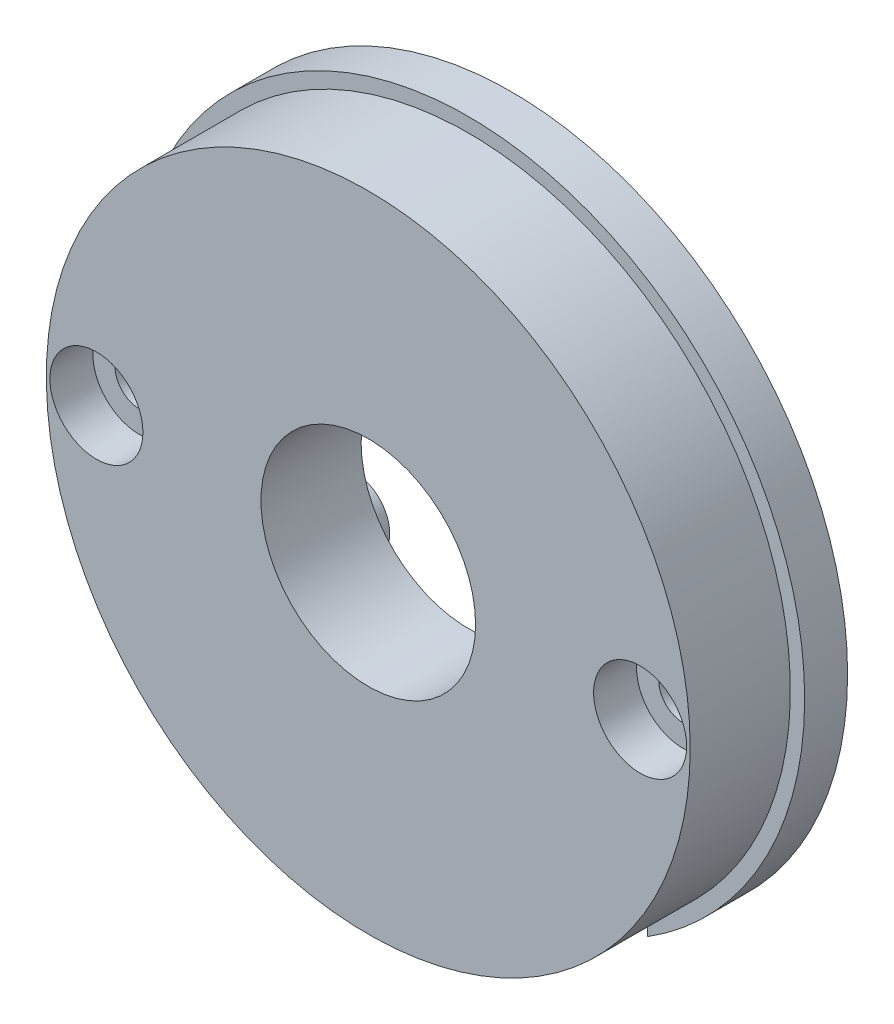
ISO-10303-21;
HEADER;
FILE_DESCRIPTION(('STEP AP214'),'2;1');
FILE_NAME('part.step','',(''),(''),'','','');
FILE_SCHEMA(('AUTOMOTIVE_DESIGN { 1 0 10303 214 1 1 1 1 }'));
ENDSEC;
DATA;
#1=APPLICATION_CONTEXT('core data for automotive mechanical design processes');
#2=APPLICATION_PROTOCOL_DEFINITION('international standard','automotive_design',2000,#1);
#3=PRODUCT_CONTEXT('',#1,'mechanical');
#4=PRODUCT('Part','Part','',(#3));
#5=PRODUCT_RELATED_PRODUCT_CATEGORY('part','',(#4));
#6=PRODUCT_DEFINITION_FORMATION('','',#4);
#7=PRODUCT_DEFINITION_CONTEXT('part definition',#1,'design');
#8=PRODUCT_DEFINITION('design','',#6,#7);
#9=PRODUCT_DEFINITION_SHAPE('','',#8);
#10=(LENGTH_UNIT() NAMED_UNIT(*) SI_UNIT(.MILLI.,.METRE.));
#11=(NAMED_UNIT(*) PLANE_ANGLE_UNIT() SI_UNIT($,.RADIAN.));
#12=(NAMED_UNIT(*) SI_UNIT($,.STERADIAN.) SOLID_ANGLE_UNIT());
#13=UNCERTAINTY_MEASURE_WITH_UNIT(LENGTH_MEASURE(1.E-05),#10,'distance_accuracy_value','');
#14=(GEOMETRIC_REPRESENTATION_CONTEXT(3) GLOBAL_UNCERTAINTY_ASSIGNED_CONTEXT((#13)) GLOBAL_UNIT_ASSIGNED_CONTEXT((#10,
#11,#12)) REPRESENTATION_CONTEXT('',''));
#15=CARTESIAN_POINT('',(0.,0.,0.));
#16=DIRECTION('',(0.,0.,1.));
#17=DIRECTION('',(1.,0.,0.));
#18=AXIS2_PLACEMENT_3D('',#15,#16,#17);
#19=CARTESIAN_POINT('',(0.,0.,10.));
#20=DIRECTION('',(0.,0.,-1.));
#21=DIRECTION('',(-1.,0.,0.));
#22=AXIS2_PLACEMENT_3D('',#19,#20,#21);
#23=CYLINDRICAL_SURFACE('',#22,22.5);
#24=CARTESIAN_POINT('',(0.,0.,10.));
#25=DIRECTION('',(0.,0.,1.));
#26=DIRECTION('',(1.,0.,0.));
#27=AXIS2_PLACEMENT_3D('',#24,#25,#26);
#28=CIRCLE('',#27,22.5);
#29=CARTESIAN_POINT('',(22.5,0.,10.));
#30=VERTEX_POINT('',#29);
#31=EDGE_CURVE('E396',#30,#30,#28,.T.);
#32=ORIENTED_EDGE('',*,*,#31,.F.);
#33=EDGE_LOOP('',(#32));
#34=FACE_BOUND('',#33,.T.);
#35=CARTESIAN_POINT('',(0.,0.,3.));
#36=DIRECTION('',(0.,0.,-1.));
#37=DIRECTION('',(-1.,0.,0.));
#38=AXIS2_PLACEMENT_3D('',#35,#36,#37);
#39=CIRCLE('',#38,22.5);
#40=CARTESIAN_POINT('',(-12.5,-18.7082869338697,3.));
#41=VERTEX_POINT('',#40);
#42=CARTESIAN_POINT('',(12.5,-18.7082869338697,3.));
#43=VERTEX_POINT('',#42);
#44=EDGE_CURVE('E191',#41,#43,#39,.T.);
#45=ORIENTED_EDGE('',*,*,#44,.F.);
#46=CARTESIAN_POINT('',(0.,0.,3.));
#47=DIRECTION('',(0.,0.,-1.));
#48=DIRECTION('',(-1.,0.,0.));
#49=AXIS2_PLACEMENT_3D('',#46,#47,#48);
#50=CIRCLE('',#49,22.5);
#51=EDGE_CURVE('E11',#43,#41,#50,.T.);
#52=ORIENTED_EDGE('',*,*,#51,.F.);
#53=EDGE_LOOP('',(#45,#52));
#54=FACE_BOUND('',#53,.T.);
#55=ADVANCED_FACE('F35',(#34,#54),#23,.T.);
#56=CARTESIAN_POINT('',(0.,0.,3.));
#57=DIRECTION('',(0.,0.,-1.));
#58=DIRECTION('',(-1.,0.,0.));
#59=AXIS2_PLACEMENT_3D('',#56,#57,#58);
#60=PLANE('',#59);
#61=CARTESIAN_POINT('',(0.,0.,3.));
#62=DIRECTION('',(0.,0.,-1.));
#63=DIRECTION('',(-1.,0.,0.));
#64=AXIS2_PLACEMENT_3D('',#61,#62,#63);
#65=CIRCLE('',#64,7.5);
#66=CARTESIAN_POINT('',(-7.5,0.,3.));
#67=VERTEX_POINT('',#66);
#68=EDGE_CURVE('E216',#67,#67,#65,.T.);
#69=ORIENTED_EDGE('',*,*,#68,.F.);
#70=EDGE_LOOP('',(#69));
#71=FACE_BOUND('',#70,.T.);
#72=DIRECTION('',(1.,0.,0.));
#73=VECTOR('',#72,1.);
#74=CARTESIAN_POINT('',(12.5,-8.,3.));
#75=LINE('',#74,#73);
#76=CARTESIAN_POINT('',(9.,-8.,3.));
#77=VERTEX_POINT('',#76);
#78=CARTESIAN_POINT('',(12.5,-8.,3.));
#79=VERTEX_POINT('',#78);
#80=EDGE_CURVE('E223',#77,#79,#75,.T.);
#81=ORIENTED_EDGE('',*,*,#80,.T.);
#82=DIRECTION('',(0.,-1.,0.));
#83=VECTOR('',#82,1.);
#84=CARTESIAN_POINT('',(12.5,17.5,3.));
#85=LINE('',#84,#83);
#86=EDGE_CURVE('E359',#79,#43,#85,.T.);
#87=ORIENTED_EDGE('',*,*,#86,.T.);
#88=ORIENTED_EDGE('',*,*,#51,.T.);
#89=DIRECTION('',(0.,1.,0.));
#90=VECTOR('',#89,1.);
#91=CARTESIAN_POINT('',(-12.5,17.5,3.));
#92=LINE('',#91,#90);
#93=CARTESIAN_POINT('',(-12.5,-8.,3.));
#94=VERTEX_POINT('',#93);
#95=EDGE_CURVE('E206',#41,#94,#92,.T.);
#96=ORIENTED_EDGE('',*,*,#95,.T.);
#97=DIRECTION('',(-1.,0.,0.));
#98=VECTOR('',#97,1.);
#99=CARTESIAN_POINT('',(-12.5,-8.,3.));
#100=LINE('',#99,#98);
#101=CARTESIAN_POINT('',(-9.,-8.,3.));
#102=VERTEX_POINT('',#101);
#103=EDGE_CURVE('E264',#102,#94,#100,.T.);
#104=ORIENTED_EDGE('',*,*,#103,.F.);
#105=CARTESIAN_POINT('',(-9.,-5.5,3.));
#106=DIRECTION('',(0.,0.,-1.));
#107=DIRECTION('',(1.,0.,0.));
#108=AXIS2_PLACEMENT_3D('',#105,#106,#107);
#109=CIRCLE('',#108,2.5);
#110=CARTESIAN_POINT('',(-9.,-3.,3.));
#111=VERTEX_POINT('',#110);
#112=EDGE_CURVE('E271',#111,#102,#109,.T.);
#113=ORIENTED_EDGE('',*,*,#112,.F.);
#114=DIRECTION('',(1.,0.,0.));
#115=VECTOR('',#114,1.);
#116=CARTESIAN_POINT('',(-12.5,-3.,3.));
#117=LINE('',#116,#115);
#118=CARTESIAN_POINT('',(-12.5,-3.,3.));
#119=VERTEX_POINT('',#118);
#120=EDGE_CURVE('E257',#119,#111,#117,.T.);
#121=ORIENTED_EDGE('',*,*,#120,.F.);
#122=CARTESIAN_POINT('',(-12.5,3.,3.));
#123=VERTEX_POINT('',#122);
#124=EDGE_CURVE('E355',#119,#123,#92,.T.);
#125=ORIENTED_EDGE('',*,*,#124,.T.);
#126=DIRECTION('',(1.,0.,0.));
#127=VECTOR('',#126,1.);
#128=CARTESIAN_POINT('',(-12.5,3.,3.));
#129=LINE('',#128,#127);
#130=CARTESIAN_POINT('',(-9.,3.,3.));
#131=VERTEX_POINT('',#130);
#132=EDGE_CURVE('E294',#123,#131,#129,.T.);
#133=ORIENTED_EDGE('',*,*,#132,.T.);
#134=CARTESIAN_POINT('',(-9.,5.5,3.));
#135=DIRECTION('',(0.,0.,1.));
#136=DIRECTION('',(1.,0.,0.));
#137=AXIS2_PLACEMENT_3D('',#134,#135,#136);
#138=CIRCLE('',#137,2.5);
#139=CARTESIAN_POINT('',(-9.,8.,3.));
#140=VERTEX_POINT('',#139);
#141=EDGE_CURVE('E306',#131,#140,#138,.T.);
#142=ORIENTED_EDGE('',*,*,#141,.T.);
#143=DIRECTION('',(-1.,0.,0.));
#144=VECTOR('',#143,1.);
#145=CARTESIAN_POINT('',(-12.5,8.,3.));
#146=LINE('',#145,#144);
#147=CARTESIAN_POINT('',(-12.5,8.,3.));
#148=VERTEX_POINT('',#147);
#149=EDGE_CURVE('E287',#140,#148,#146,.T.);
#150=ORIENTED_EDGE('',*,*,#149,.T.);
#151=CARTESIAN_POINT('',(-12.5,17.5,3.));
#152=VERTEX_POINT('',#151);
#153=EDGE_CURVE('E356',#148,#152,#92,.T.);
#154=ORIENTED_EDGE('',*,*,#153,.T.);
#155=DIRECTION('',(1.,0.,0.));
#156=VECTOR('',#155,1.);
#157=CARTESIAN_POINT('',(12.5,17.5,3.));
#158=LINE('',#157,#156);
#159=CARTESIAN_POINT('',(12.5,17.5,3.));
#160=VERTEX_POINT('',#159);
#161=EDGE_CURVE('E354',#152,#160,#158,.T.);
#162=ORIENTED_EDGE('',*,*,#161,.T.);
#163=CARTESIAN_POINT('',(12.5,8.,3.));
#164=VERTEX_POINT('',#163);
#165=EDGE_CURVE('E360',#160,#164,#85,.T.);
#166=ORIENTED_EDGE('',*,*,#165,.T.);
#167=DIRECTION('',(1.,0.,0.));
#168=VECTOR('',#167,1.);
#169=CARTESIAN_POINT('',(12.5,8.,3.));
#170=LINE('',#169,#168);
#171=CARTESIAN_POINT('',(9.,8.,3.));
#172=VERTEX_POINT('',#171);
#173=EDGE_CURVE('E330',#172,#164,#170,.T.);
#174=ORIENTED_EDGE('',*,*,#173,.F.);
#175=CARTESIAN_POINT('',(9.,5.5,3.));
#176=DIRECTION('',(0.,0.,-1.));
#177=DIRECTION('',(-1.,0.,0.));
#178=AXIS2_PLACEMENT_3D('',#175,#176,#177);
#179=CIRCLE('',#178,2.5);
#180=CARTESIAN_POINT('',(9.,3.,3.));
#181=VERTEX_POINT('',#180);
#182=EDGE_CURVE('E339',#181,#172,#179,.T.);
#183=ORIENTED_EDGE('',*,*,#182,.F.);
#184=DIRECTION('',(-1.,0.,0.));
#185=VECTOR('',#184,1.);
#186=CARTESIAN_POINT('',(12.5,3.,3.));
#187=LINE('',#186,#185);
#188=CARTESIAN_POINT('',(12.5,3.,3.));
#189=VERTEX_POINT('',#188);
#190=EDGE_CURVE('E323',#189,#181,#187,.T.);
#191=ORIENTED_EDGE('',*,*,#190,.F.);
#192=CARTESIAN_POINT('',(12.5,-3.,3.));
#193=VERTEX_POINT('',#192);
#194=EDGE_CURVE('E364',#189,#193,#85,.T.);
#195=ORIENTED_EDGE('',*,*,#194,.T.);
#196=DIRECTION('',(-1.,0.,0.));
#197=VECTOR('',#196,1.);
#198=CARTESIAN_POINT('',(12.5,-3.,3.));
#199=LINE('',#198,#197);
#200=CARTESIAN_POINT('',(9.,-3.,3.));
#201=VERTEX_POINT('',#200);
#202=EDGE_CURVE('E230',#193,#201,#199,.T.);
#203=ORIENTED_EDGE('',*,*,#202,.T.);
#204=CARTESIAN_POINT('',(9.,-5.5,3.));
#205=DIRECTION('',(0.,0.,1.));
#206=DIRECTION('',(-1.,0.,0.));
#207=AXIS2_PLACEMENT_3D('',#204,#205,#206);
#208=CIRCLE('',#207,2.5);
#209=EDGE_CURVE('E240',#201,#77,#208,.T.);
#210=ORIENTED_EDGE('',*,*,#209,.T.);
#211=EDGE_LOOP('',(#81,#87,#88,#96,#104,#113,#121,#125,#133,#142,#150,#154,#162,#166,#174,#183,
#191,#195,#203,#210));
#212=FACE_BOUND('',#211,.T.);
#213=ADVANCED_FACE('F410',(#71,#212),#60,.T.);
#214=CARTESIAN_POINT('',(-12.5,17.5,3.));
#215=DIRECTION('',(-1.,0.,0.));
#216=DIRECTION('',(0.,-1.,0.));
#217=AXIS2_PLACEMENT_3D('',#214,#215,#216);
#218=PLANE('',#217);
#219=DIRECTION('',(0.,0.,1.));
#220=VECTOR('',#219,1.);
#221=CARTESIAN_POINT('',(-12.5,-3.,2.));
#222=LINE('',#221,#220);
#223=CARTESIAN_POINT('',(-12.5,-3.,2.));
#224=VERTEX_POINT('',#223);
#225=EDGE_CURVE('E281',#224,#119,#222,.T.);
#226=ORIENTED_EDGE('',*,*,#225,.F.);
#227=DIRECTION('',(0.,1.,0.));
#228=VECTOR('',#227,1.);
#229=CARTESIAN_POINT('',(-12.5,-8.,2.));
#230=LINE('',#229,#228);
#231=CARTESIAN_POINT('',(-12.5,-8.,2.));
#232=VERTEX_POINT('',#231);
#233=EDGE_CURVE('E260',#232,#224,#230,.T.);
#234=ORIENTED_EDGE('',*,*,#233,.F.);
#235=DIRECTION('',(0.,0.,1.));
#236=VECTOR('',#235,1.);
#237=CARTESIAN_POINT('',(-12.5,-8.,2.));
#238=LINE('',#237,#236);
#239=EDGE_CURVE('E57',#232,#94,#238,.T.);
#240=ORIENTED_EDGE('',*,*,#239,.T.);
#241=ORIENTED_EDGE('',*,*,#95,.F.);
#242=DIRECTION('',(0.,-1.,0.));
#243=VECTOR('',#242,1.);
#244=CARTESIAN_POINT('',(-12.5,0.,3.));
#245=LINE('',#244,#243);
#246=CARTESIAN_POINT('',(-12.5,-19.8997487421324,3.));
#247=VERTEX_POINT('',#246);
#248=EDGE_CURVE('E197',#41,#247,#245,.T.);
#249=ORIENTED_EDGE('',*,*,#248,.T.);
#250=DIRECTION('',(0.,0.,-1.));
#251=VECTOR('',#250,1.);
#252=CARTESIAN_POINT('',(-12.5,-19.8997487421324,3.));
#253=LINE('',#252,#251);
#254=CARTESIAN_POINT('',(-12.5,-19.8997487421324,0.));
#255=VERTEX_POINT('',#254);
#256=EDGE_CURVE('E180',#247,#255,#253,.T.);
#257=ORIENTED_EDGE('',*,*,#256,.T.);
#258=DIRECTION('',(0.,-1.,0.));
#259=VECTOR('',#258,1.);
#260=CARTESIAN_POINT('',(-12.5,0.,0.));
#261=LINE('',#260,#259);
#262=CARTESIAN_POINT('',(-12.5,17.5,0.));
#263=VERTEX_POINT('',#262);
#264=EDGE_CURVE('E42',#263,#255,#261,.T.);
#265=ORIENTED_EDGE('',*,*,#264,.F.);
#266=DIRECTION('',(0.,0.,-1.));
#267=VECTOR('',#266,1.);
#268=CARTESIAN_POINT('',(-12.5,17.5,3.));
#269=LINE('',#268,#267);
#270=EDGE_CURVE('E363',#152,#263,#269,.T.);
#271=ORIENTED_EDGE('',*,*,#270,.F.);
#272=ORIENTED_EDGE('',*,*,#153,.F.);
#273=DIRECTION('',(0.,0.,1.));
#274=VECTOR('',#273,1.);
#275=CARTESIAN_POINT('',(-12.5,8.,2.));
#276=LINE('',#275,#274);
#277=CARTESIAN_POINT('',(-12.5,8.,2.));
#278=VERTEX_POINT('',#277);
#279=EDGE_CURVE('E317',#278,#148,#276,.T.);
#280=ORIENTED_EDGE('',*,*,#279,.F.);
#281=DIRECTION('',(0.,-1.,0.));
#282=VECTOR('',#281,1.);
#283=CARTESIAN_POINT('',(-12.5,8.,2.));
#284=LINE('',#283,#282);
#285=CARTESIAN_POINT('',(-12.5,3.,2.));
#286=VERTEX_POINT('',#285);
#287=EDGE_CURVE('E290',#278,#286,#284,.T.);
#288=ORIENTED_EDGE('',*,*,#287,.T.);
#289=DIRECTION('',(0.,0.,1.));
#290=VECTOR('',#289,1.);
#291=CARTESIAN_POINT('',(-12.5,3.,2.));
#292=LINE('',#291,#290);
#293=EDGE_CURVE('E303',#286,#123,#292,.T.);
#294=ORIENTED_EDGE('',*,*,#293,.T.);
#295=ORIENTED_EDGE('',*,*,#124,.F.);
#296=EDGE_LOOP('',(#226,#234,#240,#241,#249,#257,#265,#271,#272,#280,#288,#294,#295));
#297=FACE_BOUND('',#296,.T.);
#298=ADVANCED_FACE('F204',(#297),#218,.F.);
#299=CARTESIAN_POINT('',(12.5,17.5,3.));
#300=DIRECTION('',(1.,0.,0.));
#301=DIRECTION('',(0.,1.,0.));
#302=AXIS2_PLACEMENT_3D('',#299,#300,#301);
#303=PLANE('',#302);
#304=ORIENTED_EDGE('',*,*,#86,.F.);
#305=DIRECTION('',(0.,0.,1.));
#306=VECTOR('',#305,1.);
#307=CARTESIAN_POINT('',(12.5,-8.,2.));
#308=LINE('',#307,#306);
#309=CARTESIAN_POINT('',(12.5,-8.,2.));
#310=VERTEX_POINT('',#309);
#311=EDGE_CURVE('E251',#310,#79,#308,.T.);
#312=ORIENTED_EDGE('',*,*,#311,.F.);
#313=DIRECTION('',(0.,1.,0.));
#314=VECTOR('',#313,1.);
#315=CARTESIAN_POINT('',(12.5,-8.,2.));
#316=LINE('',#315,#314);
#317=CARTESIAN_POINT('',(12.5,-3.,2.));
#318=VERTEX_POINT('',#317);
#319=EDGE_CURVE('E226',#310,#318,#316,.T.);
#320=ORIENTED_EDGE('',*,*,#319,.T.);
#321=DIRECTION('',(0.,0.,1.));
#322=VECTOR('',#321,1.);
#323=CARTESIAN_POINT('',(12.5,-3.,2.));
#324=LINE('',#323,#322);
#325=EDGE_CURVE('E237',#318,#193,#324,.T.);
#326=ORIENTED_EDGE('',*,*,#325,.T.);
#327=ORIENTED_EDGE('',*,*,#194,.F.);
#328=DIRECTION('',(0.,0.,1.));
#329=VECTOR('',#328,1.);
#330=CARTESIAN_POINT('',(12.5,3.,2.));
#331=LINE('',#330,#329);
#332=CARTESIAN_POINT('',(12.5,3.,2.));
#333=VERTEX_POINT('',#332);
#334=EDGE_CURVE('E350',#333,#189,#331,.T.);
#335=ORIENTED_EDGE('',*,*,#334,.F.);
#336=DIRECTION('',(0.,-1.,0.));
#337=VECTOR('',#336,1.);
#338=CARTESIAN_POINT('',(12.5,8.,2.));
#339=LINE('',#338,#337);
#340=CARTESIAN_POINT('',(12.5,8.,2.));
#341=VERTEX_POINT('',#340);
#342=EDGE_CURVE('E326',#341,#333,#339,.T.);
#343=ORIENTED_EDGE('',*,*,#342,.F.);
#344=DIRECTION('',(0.,0.,1.));
#345=VECTOR('',#344,1.);
#346=CARTESIAN_POINT('',(12.5,8.,2.));
#347=LINE('',#346,#345);
#348=EDGE_CURVE('E337',#341,#164,#347,.T.);
#349=ORIENTED_EDGE('',*,*,#348,.T.);
#350=ORIENTED_EDGE('',*,*,#165,.F.);
#351=DIRECTION('',(0.,0.,-1.));
#352=VECTOR('',#351,1.);
#353=CARTESIAN_POINT('',(12.5,17.5,3.));
#354=LINE('',#353,#352);
#355=CARTESIAN_POINT('',(12.5,17.5,0.));
#356=VERTEX_POINT('',#355);
#357=EDGE_CURVE('E369',#160,#356,#354,.T.);
#358=ORIENTED_EDGE('',*,*,#357,.T.);
#359=DIRECTION('',(0.,-1.,0.));
#360=VECTOR('',#359,1.);
#361=CARTESIAN_POINT('',(12.5,17.5,0.));
#362=LINE('',#361,#360);
#363=CARTESIAN_POINT('',(12.5,-19.8997487421324,0.));
#364=VERTEX_POINT('',#363);
#365=EDGE_CURVE('E367',#356,#364,#362,.T.);
#366=ORIENTED_EDGE('',*,*,#365,.T.);
#367=DIRECTION('',(0.,0.,-1.));
#368=VECTOR('',#367,1.);
#369=CARTESIAN_POINT('',(12.5,-19.8997487421324,3.));
#370=LINE('',#369,#368);
#371=CARTESIAN_POINT('',(12.5,-19.8997487421324,3.));
#372=VERTEX_POINT('',#371);
#373=EDGE_CURVE('E190',#372,#364,#370,.T.);
#374=ORIENTED_EDGE('',*,*,#373,.F.);
#375=DIRECTION('',(0.,-1.,0.));
#376=VECTOR('',#375,1.);
#377=CARTESIAN_POINT('',(12.5,0.,3.));
#378=LINE('',#377,#376);
#379=EDGE_CURVE('E199',#43,#372,#378,.T.);
#380=ORIENTED_EDGE('',*,*,#379,.F.);
#381=EDGE_LOOP('',(#304,#312,#320,#326,#327,#335,#343,#349,#350,#358,#366,#374,#380));
#382=FACE_BOUND('',#381,.T.);
#383=ADVANCED_FACE('F458',(#382),#303,.F.);
#384=CARTESIAN_POINT('',(0.,0.,10.));
#385=DIRECTION('',(0.,0.,1.));
#386=DIRECTION('',(1.,0.,0.));
#387=AXIS2_PLACEMENT_3D('',#384,#385,#386);
#388=PLANE('',#387);
#389=CARTESIAN_POINT('',(0.,0.,10.));
#390=DIRECTION('',(0.,0.,1.));
#391=DIRECTION('',(1.,0.,0.));
#392=AXIS2_PLACEMENT_3D('',#389,#390,#391);
#393=CIRCLE('',#392,7.5);
#394=CARTESIAN_POINT('',(7.5,0.,10.));
#395=VERTEX_POINT('',#394);
#396=EDGE_CURVE('E212',#395,#395,#393,.T.);
#397=ORIENTED_EDGE('',*,*,#396,.F.);
#398=EDGE_LOOP('',(#397));
#399=FACE_BOUND('',#398,.T.);
#400=CARTESIAN_POINT('',(19.,0.,10.));
#401=DIRECTION('',(0.,0.,1.));
#402=DIRECTION('',(1.,0.,0.));
#403=AXIS2_PLACEMENT_3D('',#400,#401,#402);
#404=CIRCLE('',#403,3.25);
#405=CARTESIAN_POINT('',(22.25,0.,10.));
#406=VERTEX_POINT('',#405);
#407=EDGE_CURVE('E371',#406,#406,#404,.T.);
#408=ORIENTED_EDGE('',*,*,#407,.F.);
#409=EDGE_LOOP('',(#408));
#410=FACE_BOUND('',#409,.T.);
#411=CARTESIAN_POINT('',(-19.,0.,10.));
#412=DIRECTION('',(0.,0.,1.));
#413=DIRECTION('',(1.,0.,0.));
#414=AXIS2_PLACEMENT_3D('',#411,#412,#413);
#415=CIRCLE('',#414,3.25);
#416=CARTESIAN_POINT('',(-15.75,0.,10.));
#417=VERTEX_POINT('',#416);
#418=EDGE_CURVE('E384',#417,#417,#415,.T.);
#419=ORIENTED_EDGE('',*,*,#418,.F.);
#420=EDGE_LOOP('',(#419));
#421=FACE_BOUND('',#420,.T.);
#422=ORIENTED_EDGE('',*,*,#31,.T.);
#423=EDGE_LOOP('',(#422));
#424=FACE_BOUND('',#423,.T.);
#425=ADVANCED_FACE('F596',(#399,#410,#421,#424),#388,.T.);
#426=CARTESIAN_POINT('',(0.,0.,0.));
#427=DIRECTION('',(0.,0.,1.));
#428=DIRECTION('',(1.,0.,0.));
#429=AXIS2_PLACEMENT_3D('',#426,#427,#428);
#430=PLANE('',#429);
#431=CARTESIAN_POINT('',(19.,0.,0.));
#432=DIRECTION('',(0.,0.,1.));
#433=DIRECTION('',(1.,0.,0.));
#434=AXIS2_PLACEMENT_3D('',#431,#432,#433);
#435=CIRCLE('',#434,1.70000000000001);
#436=CARTESIAN_POINT('',(20.7,0.,0.));
#437=VERTEX_POINT('',#436);
#438=EDGE_CURVE('E381',#437,#437,#435,.T.);
#439=ORIENTED_EDGE('',*,*,#438,.T.);
#440=EDGE_LOOP('',(#439));
#441=FACE_BOUND('',#440,.T.);
#442=CARTESIAN_POINT('',(-19.,0.,0.));
#443=DIRECTION('',(0.,0.,1.));
#444=DIRECTION('',(1.,0.,0.));
#445=AXIS2_PLACEMENT_3D('',#442,#443,#444);
#446=CIRCLE('',#445,1.70000000000001);
#447=CARTESIAN_POINT('',(-17.3,0.,0.));
#448=VERTEX_POINT('',#447);
#449=EDGE_CURVE('E393',#448,#448,#446,.T.);
#450=ORIENTED_EDGE('',*,*,#449,.T.);
#451=EDGE_LOOP('',(#450));
#452=FACE_BOUND('',#451,.T.);
#453=DIRECTION('',(1.,0.,0.));
#454=VECTOR('',#453,1.);
#455=CARTESIAN_POINT('',(12.5,17.5,0.));
#456=LINE('',#455,#454);
#457=EDGE_CURVE('E352',#263,#356,#456,.T.);
#458=ORIENTED_EDGE('',*,*,#457,.F.);
#459=ORIENTED_EDGE('',*,*,#264,.T.);
#460=CARTESIAN_POINT('',(0.,0.,0.));
#461=DIRECTION('',(0.,0.,-1.));
#462=DIRECTION('',(-1.,0.,0.));
#463=AXIS2_PLACEMENT_3D('',#460,#461,#462);
#464=CIRCLE('',#463,23.5);
#465=EDGE_CURVE('E186',#255,#364,#464,.T.);
#466=ORIENTED_EDGE('',*,*,#465,.T.);
#467=ORIENTED_EDGE('',*,*,#365,.F.);
#468=EDGE_LOOP('',(#458,#459,#466,#467));
#469=FACE_BOUND('',#468,.T.);
#470=ADVANCED_FACE('F400',(#441,#452,#469),#430,.F.);
#471=CARTESIAN_POINT('',(-19.,0.,10.));
#472=DIRECTION('',(0.,0.,1.));
#473=DIRECTION('',(1.,0.,0.));
#474=AXIS2_PLACEMENT_3D('',#471,#472,#473);
#475=CYLINDRICAL_SURFACE('',#474,1.7);
#476=ORIENTED_EDGE('',*,*,#449,.F.);
#477=EDGE_LOOP('',(#476));
#478=FACE_BOUND('',#477,.T.);
#479=CARTESIAN_POINT('',(-19.,0.,7.));
#480=DIRECTION('',(0.,0.,1.));
#481=DIRECTION('',(1.,0.,0.));
#482=AXIS2_PLACEMENT_3D('',#479,#480,#481);
#483=CIRCLE('',#482,1.7);
#484=CARTESIAN_POINT('',(-17.3,0.,7.));
#485=VERTEX_POINT('',#484);
#486=EDGE_CURVE('E390',#485,#485,#483,.T.);
#487=ORIENTED_EDGE('',*,*,#486,.T.);
#488=EDGE_LOOP('',(#487));
#489=FACE_BOUND('',#488,.T.);
#490=ADVANCED_FACE('F647',(#478,#489),#475,.F.);
#491=CARTESIAN_POINT('',(-17.3,0.,7.));
#492=DIRECTION('',(0.,0.,-1.));
#493=DIRECTION('',(-1.,0.,0.));
#494=AXIS2_PLACEMENT_3D('',#491,#492,#493);
#495=PLANE('',#494);
#496=ORIENTED_EDGE('',*,*,#486,.F.);
#497=EDGE_LOOP('',(#496));
#498=FACE_BOUND('',#497,.T.);
#499=CARTESIAN_POINT('',(-19.,0.,7.));
#500=DIRECTION('',(0.,0.,1.));
#501=DIRECTION('',(1.,0.,0.));
#502=AXIS2_PLACEMENT_3D('',#499,#500,#501);
#503=CIRCLE('',#502,3.25);
#504=CARTESIAN_POINT('',(-15.75,0.,7.));
#505=VERTEX_POINT('',#504);
#506=EDGE_CURVE('E387',#505,#505,#503,.T.);
#507=ORIENTED_EDGE('',*,*,#506,.T.);
#508=EDGE_LOOP('',(#507));
#509=FACE_BOUND('',#508,.T.);
#510=ADVANCED_FACE('F670',(#498,#509),#495,.F.);
#511=CARTESIAN_POINT('',(-19.,0.,10.));
#512=DIRECTION('',(0.,0.,1.));
#513=DIRECTION('',(1.,0.,0.));
#514=AXIS2_PLACEMENT_3D('',#511,#512,#513);
#515=CYLINDRICAL_SURFACE('',#514,3.25);
#516=ORIENTED_EDGE('',*,*,#506,.F.);
#517=EDGE_LOOP('',(#516));
#518=FACE_BOUND('',#517,.T.);
#519=ORIENTED_EDGE('',*,*,#418,.T.);
#520=EDGE_LOOP('',(#519));
#521=FACE_BOUND('',#520,.T.);
#522=ADVANCED_FACE('F678',(#518,#521),#515,.F.);
#523=CARTESIAN_POINT('',(19.,0.,10.));
#524=DIRECTION('',(0.,0.,1.));
#525=DIRECTION('',(1.,0.,0.));
#526=AXIS2_PLACEMENT_3D('',#523,#524,#525);
#527=CYLINDRICAL_SURFACE('',#526,1.7);
#528=ORIENTED_EDGE('',*,*,#438,.F.);
#529=EDGE_LOOP('',(#528));
#530=FACE_BOUND('',#529,.T.);
#531=CARTESIAN_POINT('',(19.,0.,7.));
#532=DIRECTION('',(0.,0.,1.));
#533=DIRECTION('',(1.,0.,0.));
#534=AXIS2_PLACEMENT_3D('',#531,#532,#533);
#535=CIRCLE('',#534,1.7);
#536=CARTESIAN_POINT('',(20.7,0.,7.));
#537=VERTEX_POINT('',#536);
#538=EDGE_CURVE('E378',#537,#537,#535,.T.);
#539=ORIENTED_EDGE('',*,*,#538,.T.);
#540=EDGE_LOOP('',(#539));
#541=FACE_BOUND('',#540,.T.);
#542=ADVANCED_FACE('F686',(#530,#541),#527,.F.);
#543=CARTESIAN_POINT('',(20.7,0.,7.));
#544=DIRECTION('',(0.,0.,-1.));
#545=DIRECTION('',(-1.,0.,0.));
#546=AXIS2_PLACEMENT_3D('',#543,#544,#545);
#547=PLANE('',#546);
#548=ORIENTED_EDGE('',*,*,#538,.F.);
#549=EDGE_LOOP('',(#548));
#550=FACE_BOUND('',#549,.T.);
#551=CARTESIAN_POINT('',(19.,0.,7.));
#552=DIRECTION('',(0.,0.,1.));
#553=DIRECTION('',(1.,0.,0.));
#554=AXIS2_PLACEMENT_3D('',#551,#552,#553);
#555=CIRCLE('',#554,3.25);
#556=CARTESIAN_POINT('',(22.25,0.,7.));
#557=VERTEX_POINT('',#556);
#558=EDGE_CURVE('E375',#557,#557,#555,.T.);
#559=ORIENTED_EDGE('',*,*,#558,.T.);
#560=EDGE_LOOP('',(#559));
#561=FACE_BOUND('',#560,.T.);
#562=ADVANCED_FACE('F694',(#550,#561),#547,.F.);
#563=CARTESIAN_POINT('',(19.,0.,10.));
#564=DIRECTION('',(0.,0.,1.));
#565=DIRECTION('',(1.,0.,0.));
#566=AXIS2_PLACEMENT_3D('',#563,#564,#565);
#567=CYLINDRICAL_SURFACE('',#566,3.25);
#568=ORIENTED_EDGE('',*,*,#558,.F.);
#569=EDGE_LOOP('',(#568));
#570=FACE_BOUND('',#569,.T.);
#571=ORIENTED_EDGE('',*,*,#407,.T.);
#572=EDGE_LOOP('',(#571));
#573=FACE_BOUND('',#572,.T.);
#574=ADVANCED_FACE('F702',(#570,#573),#567,.F.);
#575=CARTESIAN_POINT('',(12.5,17.5,3.));
#576=DIRECTION('',(0.,1.,0.));
#577=DIRECTION('',(0.,0.,1.));
#578=AXIS2_PLACEMENT_3D('',#575,#576,#577);
#579=PLANE('',#578);
#580=ORIENTED_EDGE('',*,*,#457,.T.);
#581=ORIENTED_EDGE('',*,*,#357,.F.);
#582=ORIENTED_EDGE('',*,*,#161,.F.);
#583=ORIENTED_EDGE('',*,*,#270,.T.);
#584=EDGE_LOOP('',(#580,#581,#582,#583));
#585=FACE_BOUND('',#584,.T.);
#586=ADVANCED_FACE('F407',(#585),#579,.F.);
#587=CARTESIAN_POINT('',(12.5,3.,2.));
#588=DIRECTION('',(0.,1.,0.));
#589=DIRECTION('',(-1.,0.,0.));
#590=AXIS2_PLACEMENT_3D('',#587,#588,#589);
#591=PLANE('',#590);
#592=ORIENTED_EDGE('',*,*,#190,.T.);
#593=DIRECTION('',(0.,0.,1.));
#594=VECTOR('',#593,1.);
#595=CARTESIAN_POINT('',(9.,3.,2.));
#596=LINE('',#595,#594);
#597=CARTESIAN_POINT('',(9.,3.,2.));
#598=VERTEX_POINT('',#597);
#599=EDGE_CURVE('E347',#598,#181,#596,.T.);
#600=ORIENTED_EDGE('',*,*,#599,.F.);
#601=DIRECTION('',(-1.,0.,0.));
#602=VECTOR('',#601,1.);
#603=CARTESIAN_POINT('',(12.5,3.,2.));
#604=LINE('',#603,#602);
#605=EDGE_CURVE('E329',#333,#598,#604,.T.);
#606=ORIENTED_EDGE('',*,*,#605,.F.);
#607=ORIENTED_EDGE('',*,*,#334,.T.);
#608=EDGE_LOOP('',(#592,#600,#606,#607));
#609=FACE_BOUND('',#608,.T.);
#610=ADVANCED_FACE('F717',(#609),#591,.F.);
#611=CARTESIAN_POINT('',(9.,5.5,2.));
#612=DIRECTION('',(0.,0.,1.));
#613=DIRECTION('',(1.,0.,0.));
#614=AXIS2_PLACEMENT_3D('',#611,#612,#613);
#615=CYLINDRICAL_SURFACE('',#614,2.5);
#616=ORIENTED_EDGE('',*,*,#182,.T.);
#617=DIRECTION('',(0.,0.,1.));
#618=VECTOR('',#617,1.);
#619=CARTESIAN_POINT('',(9.,8.,2.));
#620=LINE('',#619,#618);
#621=CARTESIAN_POINT('',(9.,8.,2.));
#622=VERTEX_POINT('',#621);
#623=EDGE_CURVE('E344',#622,#172,#620,.T.);
#624=ORIENTED_EDGE('',*,*,#623,.F.);
#625=CARTESIAN_POINT('',(9.,5.5,2.));
#626=DIRECTION('',(0.,0.,-1.));
#627=DIRECTION('',(-1.,0.,0.));
#628=AXIS2_PLACEMENT_3D('',#625,#626,#627);
#629=CIRCLE('',#628,2.5);
#630=EDGE_CURVE('E332',#598,#622,#629,.T.);
#631=ORIENTED_EDGE('',*,*,#630,.F.);
#632=ORIENTED_EDGE('',*,*,#599,.T.);
#633=EDGE_LOOP('',(#616,#624,#631,#632));
#634=FACE_BOUND('',#633,.T.);
#635=ADVANCED_FACE('F724',(#634),#615,.T.);
#636=CARTESIAN_POINT('',(12.5,8.,2.));
#637=DIRECTION('',(0.,-1.,0.));
#638=DIRECTION('',(0.,0.,-1.));
#639=AXIS2_PLACEMENT_3D('',#636,#637,#638);
#640=PLANE('',#639);
#641=ORIENTED_EDGE('',*,*,#173,.T.);
#642=ORIENTED_EDGE('',*,*,#348,.F.);
#643=DIRECTION('',(1.,0.,0.));
#644=VECTOR('',#643,1.);
#645=CARTESIAN_POINT('',(12.5,8.,2.));
#646=LINE('',#645,#644);
#647=EDGE_CURVE('E334',#622,#341,#646,.T.);
#648=ORIENTED_EDGE('',*,*,#647,.F.);
#649=ORIENTED_EDGE('',*,*,#623,.T.);
#650=EDGE_LOOP('',(#641,#642,#648,#649));
#651=FACE_BOUND('',#650,.T.);
#652=ADVANCED_FACE('F732',(#651),#640,.F.);
#653=CARTESIAN_POINT('',(9.,5.5,2.));
#654=DIRECTION('',(0.,0.,-1.));
#655=DIRECTION('',(-1.,0.,0.));
#656=AXIS2_PLACEMENT_3D('',#653,#654,#655);
#657=PLANE('',#656);
#658=CARTESIAN_POINT('',(9.,5.5,2.));
#659=DIRECTION('',(0.,0.,-1.));
#660=DIRECTION('',(-1.,0.,0.));
#661=AXIS2_PLACEMENT_3D('',#658,#659,#660);
#662=CIRCLE('',#661,1.75);
#663=CARTESIAN_POINT('',(7.25,5.5,2.));
#664=VERTEX_POINT('',#663);
#665=EDGE_CURVE('E319',#664,#664,#662,.T.);
#666=ORIENTED_EDGE('',*,*,#665,.F.);
#667=EDGE_LOOP('',(#666));
#668=FACE_BOUND('',#667,.T.);
#669=ORIENTED_EDGE('',*,*,#342,.T.);
#670=ORIENTED_EDGE('',*,*,#605,.T.);
#671=ORIENTED_EDGE('',*,*,#630,.T.);
#672=ORIENTED_EDGE('',*,*,#647,.T.);
#673=EDGE_LOOP('',(#669,#670,#671,#672));
#674=FACE_BOUND('',#673,.T.);
#675=ADVANCED_FACE('F740',(#668,#674),#657,.T.);
#676=CARTESIAN_POINT('',(9.,5.5,5.));
#677=DIRECTION('',(0.,0.,-1.));
#678=DIRECTION('',(-1.,0.,0.));
#679=AXIS2_PLACEMENT_3D('',#676,#677,#678);
#680=CYLINDRICAL_SURFACE('',#679,1.75);
#681=CARTESIAN_POINT('',(9.,5.5,5.));
#682=DIRECTION('',(0.,0.,-1.));
#683=DIRECTION('',(-1.,0.,0.));
#684=AXIS2_PLACEMENT_3D('',#681,#682,#683);
#685=CIRCLE('',#684,1.75);
#686=CARTESIAN_POINT('',(7.25,5.5,5.));
#687=VERTEX_POINT('',#686);
#688=EDGE_CURVE('E320',#687,#687,#685,.T.);
#689=ORIENTED_EDGE('',*,*,#688,.F.);
#690=EDGE_LOOP('',(#689));
#691=FACE_BOUND('',#690,.T.);
#692=ORIENTED_EDGE('',*,*,#665,.T.);
#693=EDGE_LOOP('',(#692));
#694=FACE_BOUND('',#693,.T.);
#695=ADVANCED_FACE('F748',(#691,#694),#680,.F.);
#696=CARTESIAN_POINT('',(9.,5.5,5.));
#697=DIRECTION('',(0.,0.,-1.));
#698=DIRECTION('',(-1.,0.,0.));
#699=AXIS2_PLACEMENT_3D('',#696,#697,#698);
#700=PLANE('',#699);
#701=ORIENTED_EDGE('',*,*,#688,.T.);
#702=EDGE_LOOP('',(#701));
#703=FACE_BOUND('',#702,.T.);
#704=ADVANCED_FACE('F436',(#703),#700,.T.);
#705=CARTESIAN_POINT('',(-12.5,8.,2.));
#706=DIRECTION('',(0.,1.,0.));
#707=DIRECTION('',(0.,0.,1.));
#708=AXIS2_PLACEMENT_3D('',#705,#706,#707);
#709=PLANE('',#708);
#710=ORIENTED_EDGE('',*,*,#149,.F.);
#711=DIRECTION('',(0.,0.,1.));
#712=VECTOR('',#711,1.);
#713=CARTESIAN_POINT('',(-9.,8.,2.));
#714=LINE('',#713,#712);
#715=CARTESIAN_POINT('',(-9.,8.,2.));
#716=VERTEX_POINT('',#715);
#717=EDGE_CURVE('E315',#716,#140,#714,.T.);
#718=ORIENTED_EDGE('',*,*,#717,.F.);
#719=DIRECTION('',(-1.,0.,0.));
#720=VECTOR('',#719,1.);
#721=CARTESIAN_POINT('',(-12.5,8.,2.));
#722=LINE('',#721,#720);
#723=EDGE_CURVE('E293',#716,#278,#722,.T.);
#724=ORIENTED_EDGE('',*,*,#723,.T.);
#725=ORIENTED_EDGE('',*,*,#279,.T.);
#726=EDGE_LOOP('',(#710,#718,#724,#725));
#727=FACE_BOUND('',#726,.T.);
#728=ADVANCED_FACE('F426',(#727),#709,.T.);
#729=CARTESIAN_POINT('',(-9.,5.5,2.));
#730=DIRECTION('',(0.,0.,1.));
#731=DIRECTION('',(1.,0.,0.));
#732=AXIS2_PLACEMENT_3D('',#729,#730,#731);
#733=CYLINDRICAL_SURFACE('',#732,2.5);
#734=ORIENTED_EDGE('',*,*,#141,.F.);
#735=DIRECTION('',(0.,0.,1.));
#736=VECTOR('',#735,1.);
#737=CARTESIAN_POINT('',(-9.,3.,2.));
#738=LINE('',#737,#736);
#739=CARTESIAN_POINT('',(-9.,3.,2.));
#740=VERTEX_POINT('',#739);
#741=EDGE_CURVE('E313',#740,#131,#738,.T.);
#742=ORIENTED_EDGE('',*,*,#741,.F.);
#743=CARTESIAN_POINT('',(-9.,5.5,2.));
#744=DIRECTION('',(0.,0.,1.));
#745=DIRECTION('',(1.,0.,0.));
#746=AXIS2_PLACEMENT_3D('',#743,#744,#745);
#747=CIRCLE('',#746,2.5);
#748=EDGE_CURVE('E297',#740,#716,#747,.T.);
#749=ORIENTED_EDGE('',*,*,#748,.T.);
#750=ORIENTED_EDGE('',*,*,#717,.T.);
#751=EDGE_LOOP('',(#734,#742,#749,#750));
#752=FACE_BOUND('',#751,.T.);
#753=ADVANCED_FACE('F428',(#752),#733,.T.);
#754=CARTESIAN_POINT('',(-12.5,3.,2.));
#755=DIRECTION('',(0.,-1.,0.));
#756=DIRECTION('',(1.,0.,0.));
#757=AXIS2_PLACEMENT_3D('',#754,#755,#756);
#758=PLANE('',#757);
#759=ORIENTED_EDGE('',*,*,#132,.F.);
#760=ORIENTED_EDGE('',*,*,#293,.F.);
#761=DIRECTION('',(1.,0.,0.));
#762=VECTOR('',#761,1.);
#763=CARTESIAN_POINT('',(-12.5,3.,2.));
#764=LINE('',#763,#762);
#765=EDGE_CURVE('E300',#286,#740,#764,.T.);
#766=ORIENTED_EDGE('',*,*,#765,.T.);
#767=ORIENTED_EDGE('',*,*,#741,.T.);
#768=EDGE_LOOP('',(#759,#760,#766,#767));
#769=FACE_BOUND('',#768,.T.);
#770=ADVANCED_FACE('F419',(#769),#758,.T.);
#771=CARTESIAN_POINT('',(-9.,5.5,2.));
#772=DIRECTION('',(0.,0.,-1.));
#773=DIRECTION('',(1.,0.,0.));
#774=AXIS2_PLACEMENT_3D('',#771,#772,#773);
#775=PLANE('',#774);
#776=CARTESIAN_POINT('',(-9.,5.5,2.));
#777=DIRECTION('',(0.,0.,1.));
#778=DIRECTION('',(1.,0.,0.));
#779=AXIS2_PLACEMENT_3D('',#776,#777,#778);
#780=CIRCLE('',#779,1.75);
#781=CARTESIAN_POINT('',(-7.25,5.5,2.));
#782=VERTEX_POINT('',#781);
#783=EDGE_CURVE('E283',#782,#782,#780,.T.);
#784=ORIENTED_EDGE('',*,*,#783,.T.);
#785=EDGE_LOOP('',(#784));
#786=FACE_BOUND('',#785,.T.);
#787=ORIENTED_EDGE('',*,*,#287,.F.);
#788=ORIENTED_EDGE('',*,*,#723,.F.);
#789=ORIENTED_EDGE('',*,*,#748,.F.);
#790=ORIENTED_EDGE('',*,*,#765,.F.);
#791=EDGE_LOOP('',(#787,#788,#789,#790));
#792=FACE_BOUND('',#791,.T.);
#793=ADVANCED_FACE('F423',(#786,#792),#775,.T.);
#794=CARTESIAN_POINT('',(-9.,5.5,5.));
#795=DIRECTION('',(0.,0.,-1.));
#796=DIRECTION('',(-1.,0.,0.));
#797=AXIS2_PLACEMENT_3D('',#794,#795,#796);
#798=CYLINDRICAL_SURFACE('',#797,1.75);
#799=CARTESIAN_POINT('',(-9.,5.5,5.));
#800=DIRECTION('',(0.,0.,1.));
#801=DIRECTION('',(1.,0.,0.));
#802=AXIS2_PLACEMENT_3D('',#799,#800,#801);
#803=CIRCLE('',#802,1.75);
#804=CARTESIAN_POINT('',(-7.25,5.5,5.));
#805=VERTEX_POINT('',#804);
#806=EDGE_CURVE('E284',#805,#805,#803,.T.);
#807=ORIENTED_EDGE('',*,*,#806,.T.);
#808=EDGE_LOOP('',(#807));
#809=FACE_BOUND('',#808,.T.);
#810=ORIENTED_EDGE('',*,*,#783,.F.);
#811=EDGE_LOOP('',(#810));
#812=FACE_BOUND('',#811,.T.);
#813=ADVANCED_FACE('F513',(#809,#812),#798,.F.);
#814=CARTESIAN_POINT('',(-9.,5.5,5.));
#815=DIRECTION('',(0.,0.,-1.));
#816=DIRECTION('',(1.,0.,0.));
#817=AXIS2_PLACEMENT_3D('',#814,#815,#816);
#818=PLANE('',#817);
#819=ORIENTED_EDGE('',*,*,#806,.F.);
#820=EDGE_LOOP('',(#819));
#821=FACE_BOUND('',#820,.T.);
#822=ADVANCED_FACE('F509',(#821),#818,.T.);
#823=CARTESIAN_POINT('',(-12.5,-3.,2.));
#824=DIRECTION('',(0.,-1.,0.));
#825=DIRECTION('',(1.,0.,0.));
#826=AXIS2_PLACEMENT_3D('',#823,#824,#825);
#827=PLANE('',#826);
#828=ORIENTED_EDGE('',*,*,#120,.T.);
#829=DIRECTION('',(0.,0.,1.));
#830=VECTOR('',#829,1.);
#831=CARTESIAN_POINT('',(-9.,-3.,2.));
#832=LINE('',#831,#830);
#833=CARTESIAN_POINT('',(-9.,-3.,2.));
#834=VERTEX_POINT('',#833);
#835=EDGE_CURVE('E278',#834,#111,#832,.T.);
#836=ORIENTED_EDGE('',*,*,#835,.F.);
#837=DIRECTION('',(1.,0.,0.));
#838=VECTOR('',#837,1.);
#839=CARTESIAN_POINT('',(-12.5,-3.,2.));
#840=LINE('',#839,#838);
#841=EDGE_CURVE('E263',#224,#834,#840,.T.);
#842=ORIENTED_EDGE('',*,*,#841,.F.);
#843=ORIENTED_EDGE('',*,*,#225,.T.);
#844=EDGE_LOOP('',(#828,#836,#842,#843));
#845=FACE_BOUND('',#844,.T.);
#846=ADVANCED_FACE('F505',(#845),#827,.F.);
#847=CARTESIAN_POINT('',(-9.,-5.5,2.));
#848=DIRECTION('',(0.,0.,1.));
#849=DIRECTION('',(1.,0.,0.));
#850=AXIS2_PLACEMENT_3D('',#847,#848,#849);
#851=CYLINDRICAL_SURFACE('',#850,2.5);
#852=ORIENTED_EDGE('',*,*,#112,.T.);
#853=DIRECTION('',(0.,0.,1.));
#854=VECTOR('',#853,1.);
#855=CARTESIAN_POINT('',(-9.,-8.,2.));
#856=LINE('',#855,#854);
#857=CARTESIAN_POINT('',(-9.,-8.,2.));
#858=VERTEX_POINT('',#857);
#859=EDGE_CURVE('E275',#858,#102,#856,.T.);
#860=ORIENTED_EDGE('',*,*,#859,.F.);
#861=CARTESIAN_POINT('',(-9.,-5.5,2.));
#862=DIRECTION('',(0.,0.,-1.));
#863=DIRECTION('',(1.,0.,0.));
#864=AXIS2_PLACEMENT_3D('',#861,#862,#863);
#865=CIRCLE('',#864,2.5);
#866=EDGE_CURVE('E266',#834,#858,#865,.T.);
#867=ORIENTED_EDGE('',*,*,#866,.F.);
#868=ORIENTED_EDGE('',*,*,#835,.T.);
#869=EDGE_LOOP('',(#852,#860,#867,#868));
#870=FACE_BOUND('',#869,.T.);
#871=ADVANCED_FACE('F502',(#870),#851,.T.);
#872=CARTESIAN_POINT('',(-12.5,-8.,2.));
#873=DIRECTION('',(0.,1.,0.));
#874=DIRECTION('',(0.,0.,1.));
#875=AXIS2_PLACEMENT_3D('',#872,#873,#874);
#876=PLANE('',#875);
#877=ORIENTED_EDGE('',*,*,#103,.T.);
#878=ORIENTED_EDGE('',*,*,#239,.F.);
#879=DIRECTION('',(-1.,0.,0.));
#880=VECTOR('',#879,1.);
#881=CARTESIAN_POINT('',(-12.5,-8.,2.));
#882=LINE('',#881,#880);
#883=EDGE_CURVE('E268',#858,#232,#882,.T.);
#884=ORIENTED_EDGE('',*,*,#883,.F.);
#885=ORIENTED_EDGE('',*,*,#859,.T.);
#886=EDGE_LOOP('',(#877,#878,#884,#885));
#887=FACE_BOUND('',#886,.T.);
#888=ADVANCED_FACE('F498',(#887),#876,.F.);
#889=CARTESIAN_POINT('',(-9.,-5.5,2.));
#890=DIRECTION('',(0.,0.,-1.));
#891=DIRECTION('',(1.,0.,0.));
#892=AXIS2_PLACEMENT_3D('',#889,#890,#891);
#893=PLANE('',#892);
#894=CARTESIAN_POINT('',(-9.,-5.5,2.));
#895=DIRECTION('',(0.,0.,-1.));
#896=DIRECTION('',(1.,0.,0.));
#897=AXIS2_PLACEMENT_3D('',#894,#895,#896);
#898=CIRCLE('',#897,1.75);
#899=CARTESIAN_POINT('',(-7.25,-5.5,2.));
#900=VERTEX_POINT('',#899);
#901=EDGE_CURVE('E253',#900,#900,#898,.T.);
#902=ORIENTED_EDGE('',*,*,#901,.F.);
#903=EDGE_LOOP('',(#902));
#904=FACE_BOUND('',#903,.T.);
#905=ORIENTED_EDGE('',*,*,#233,.T.);
#906=ORIENTED_EDGE('',*,*,#841,.T.);
#907=ORIENTED_EDGE('',*,*,#866,.T.);
#908=ORIENTED_EDGE('',*,*,#883,.T.);
#909=EDGE_LOOP('',(#905,#906,#907,#908));
#910=FACE_BOUND('',#909,.T.);
#911=ADVANCED_FACE('F494',(#904,#910),#893,.T.);
#912=CARTESIAN_POINT('',(-9.,-5.5,5.));
#913=DIRECTION('',(0.,0.,-1.));
#914=DIRECTION('',(-1.,0.,0.));
#915=AXIS2_PLACEMENT_3D('',#912,#913,#914);
#916=CYLINDRICAL_SURFACE('',#915,1.75);
#917=CARTESIAN_POINT('',(-9.,-5.5,5.));
#918=DIRECTION('',(0.,0.,-1.));
#919=DIRECTION('',(1.,0.,0.));
#920=AXIS2_PLACEMENT_3D('',#917,#918,#919);
#921=CIRCLE('',#920,1.75);
#922=CARTESIAN_POINT('',(-7.25,-5.5,5.));
#923=VERTEX_POINT('',#922);
#924=EDGE_CURVE('E254',#923,#923,#921,.T.);
#925=ORIENTED_EDGE('',*,*,#924,.F.);
#926=EDGE_LOOP('',(#925));
#927=FACE_BOUND('',#926,.T.);
#928=ORIENTED_EDGE('',*,*,#901,.T.);
#929=EDGE_LOOP('',(#928));
#930=FACE_BOUND('',#929,.T.);
#931=ADVANCED_FACE('F490',(#927,#930),#916,.F.);
#932=CARTESIAN_POINT('',(-9.,-5.5,5.));
#933=DIRECTION('',(0.,0.,-1.));
#934=DIRECTION('',(1.,0.,0.));
#935=AXIS2_PLACEMENT_3D('',#932,#933,#934);
#936=PLANE('',#935);
#937=ORIENTED_EDGE('',*,*,#924,.T.);
#938=EDGE_LOOP('',(#937));
#939=FACE_BOUND('',#938,.T.);
#940=ADVANCED_FACE('F487',(#939),#936,.T.);
#941=CARTESIAN_POINT('',(12.5,-8.,2.));
#942=DIRECTION('',(0.,-1.,0.));
#943=DIRECTION('',(0.,0.,-1.));
#944=AXIS2_PLACEMENT_3D('',#941,#942,#943);
#945=PLANE('',#944);
#946=ORIENTED_EDGE('',*,*,#80,.F.);
#947=DIRECTION('',(0.,0.,1.));
#948=VECTOR('',#947,1.);
#949=CARTESIAN_POINT('',(9.,-8.,2.));
#950=LINE('',#949,#948);
#951=CARTESIAN_POINT('',(9.,-8.,2.));
#952=VERTEX_POINT('',#951);
#953=EDGE_CURVE('E249',#952,#77,#950,.T.);
#954=ORIENTED_EDGE('',*,*,#953,.F.);
#955=DIRECTION('',(1.,0.,0.));
#956=VECTOR('',#955,1.);
#957=CARTESIAN_POINT('',(12.5,-8.,2.));
#958=LINE('',#957,#956);
#959=EDGE_CURVE('E229',#952,#310,#958,.T.);
#960=ORIENTED_EDGE('',*,*,#959,.T.);
#961=ORIENTED_EDGE('',*,*,#311,.T.);
#962=EDGE_LOOP('',(#946,#954,#960,#961));
#963=FACE_BOUND('',#962,.T.);
#964=ADVANCED_FACE('F467',(#963),#945,.T.);
#965=CARTESIAN_POINT('',(9.,-5.5,2.));
#966=DIRECTION('',(0.,0.,1.));
#967=DIRECTION('',(1.,0.,0.));
#968=AXIS2_PLACEMENT_3D('',#965,#966,#967);
#969=CYLINDRICAL_SURFACE('',#968,2.5);
#970=ORIENTED_EDGE('',*,*,#209,.F.);
#971=DIRECTION('',(0.,0.,1.));
#972=VECTOR('',#971,1.);
#973=CARTESIAN_POINT('',(9.,-3.,2.));
#974=LINE('',#973,#972);
#975=CARTESIAN_POINT('',(9.,-3.,2.));
#976=VERTEX_POINT('',#975);
#977=EDGE_CURVE('E247',#976,#201,#974,.T.);
#978=ORIENTED_EDGE('',*,*,#977,.F.);
#979=CARTESIAN_POINT('',(9.,-5.5,2.));
#980=DIRECTION('',(0.,0.,1.));
#981=DIRECTION('',(-1.,0.,0.));
#982=AXIS2_PLACEMENT_3D('',#979,#980,#981);
#983=CIRCLE('',#982,2.5);
#984=EDGE_CURVE('E233',#976,#952,#983,.T.);
#985=ORIENTED_EDGE('',*,*,#984,.T.);
#986=ORIENTED_EDGE('',*,*,#953,.T.);
#987=EDGE_LOOP('',(#970,#978,#985,#986));
#988=FACE_BOUND('',#987,.T.);
#989=ADVANCED_FACE('F464',(#988),#969,.T.);
#990=CARTESIAN_POINT('',(12.5,-3.,2.));
#991=DIRECTION('',(0.,1.,0.));
#992=DIRECTION('',(-1.,0.,0.));
#993=AXIS2_PLACEMENT_3D('',#990,#991,#992);
#994=PLANE('',#993);
#995=ORIENTED_EDGE('',*,*,#202,.F.);
#996=ORIENTED_EDGE('',*,*,#325,.F.);
#997=DIRECTION('',(-1.,0.,0.));
#998=VECTOR('',#997,1.);
#999=CARTESIAN_POINT('',(12.5,-3.,2.));
#1000=LINE('',#999,#998);
#1001=EDGE_CURVE('E49',#318,#976,#1000,.T.);
#1002=ORIENTED_EDGE('',*,*,#1001,.T.);
#1003=ORIENTED_EDGE('',*,*,#977,.T.);
#1004=EDGE_LOOP('',(#995,#996,#1002,#1003));
#1005=FACE_BOUND('',#1004,.T.);
#1006=ADVANCED_FACE('F461',(#1005),#994,.T.);
#1007=CARTESIAN_POINT('',(9.,-5.5,2.));
#1008=DIRECTION('',(0.,0.,-1.));
#1009=DIRECTION('',(-1.,0.,0.));
#1010=AXIS2_PLACEMENT_3D('',#1007,#1008,#1009);
#1011=PLANE('',#1010);
#1012=CARTESIAN_POINT('',(9.,-5.5,2.));
#1013=DIRECTION('',(0.,0.,1.));
#1014=DIRECTION('',(-1.,0.,0.));
#1015=AXIS2_PLACEMENT_3D('',#1012,#1013,#1014);
#1016=CIRCLE('',#1015,1.75);
#1017=CARTESIAN_POINT('',(7.25,-5.5,2.));
#1018=VERTEX_POINT('',#1017);
#1019=EDGE_CURVE('E219',#1018,#1018,#1016,.T.);
#1020=ORIENTED_EDGE('',*,*,#1019,.T.);
#1021=EDGE_LOOP('',(#1020));
#1022=FACE_BOUND('',#1021,.T.);
#1023=ORIENTED_EDGE('',*,*,#319,.F.);
#1024=ORIENTED_EDGE('',*,*,#959,.F.);
#1025=ORIENTED_EDGE('',*,*,#984,.F.);
#1026=ORIENTED_EDGE('',*,*,#1001,.F.);
#1027=EDGE_LOOP('',(#1023,#1024,#1025,#1026));
#1028=FACE_BOUND('',#1027,.T.);
#1029=ADVANCED_FACE('F468',(#1022,#1028),#1011,.T.);
#1030=CARTESIAN_POINT('',(9.,-5.5,5.));
#1031=DIRECTION('',(0.,0.,-1.));
#1032=DIRECTION('',(-1.,0.,0.));
#1033=AXIS2_PLACEMENT_3D('',#1030,#1031,#1032);
#1034=CYLINDRICAL_SURFACE('',#1033,1.75);
#1035=CARTESIAN_POINT('',(9.,-5.5,5.));
#1036=DIRECTION('',(0.,0.,1.));
#1037=DIRECTION('',(-1.,0.,0.));
#1038=AXIS2_PLACEMENT_3D('',#1035,#1036,#1037);
#1039=CIRCLE('',#1038,1.75);
#1040=CARTESIAN_POINT('',(7.25,-5.5,5.));
#1041=VERTEX_POINT('',#1040);
#1042=EDGE_CURVE('E220',#1041,#1041,#1039,.T.);
#1043=ORIENTED_EDGE('',*,*,#1042,.T.);
#1044=EDGE_LOOP('',(#1043));
#1045=FACE_BOUND('',#1044,.T.);
#1046=ORIENTED_EDGE('',*,*,#1019,.F.);
#1047=EDGE_LOOP('',(#1046));
#1048=FACE_BOUND('',#1047,.T.);
#1049=ADVANCED_FACE('F470',(#1045,#1048),#1034,.F.);
#1050=CARTESIAN_POINT('',(9.,-5.5,5.));
#1051=DIRECTION('',(0.,0.,-1.));
#1052=DIRECTION('',(-1.,0.,0.));
#1053=AXIS2_PLACEMENT_3D('',#1050,#1051,#1052);
#1054=PLANE('',#1053);
#1055=ORIENTED_EDGE('',*,*,#1042,.F.);
#1056=EDGE_LOOP('',(#1055));
#1057=FACE_BOUND('',#1056,.T.);
#1058=ADVANCED_FACE('F477',(#1057),#1054,.T.);
#1059=CARTESIAN_POINT('',(0.,0.,0.));
#1060=DIRECTION('',(0.,0.,1.));
#1061=DIRECTION('',(1.,0.,0.));
#1062=AXIS2_PLACEMENT_3D('',#1059,#1060,#1061);
#1063=CYLINDRICAL_SURFACE('',#1062,7.5);
#1064=ORIENTED_EDGE('',*,*,#68,.T.);
#1065=EDGE_LOOP('',(#1064));
#1066=FACE_BOUND('',#1065,.T.);
#1067=ORIENTED_EDGE('',*,*,#396,.T.);
#1068=EDGE_LOOP('',(#1067));
#1069=FACE_BOUND('',#1068,.T.);
#1070=ADVANCED_FACE('F589',(#1066,#1069),#1063,.F.);
#1071=CARTESIAN_POINT('',(0.,0.,3.));
#1072=DIRECTION('',(0.,0.,-1.));
#1073=DIRECTION('',(-1.,0.,0.));
#1074=AXIS2_PLACEMENT_3D('',#1071,#1072,#1073);
#1075=CYLINDRICAL_SURFACE('',#1074,23.5);
#1076=ORIENTED_EDGE('',*,*,#465,.F.);
#1077=ORIENTED_EDGE('',*,*,#256,.F.);
#1078=CARTESIAN_POINT('',(0.,0.,3.));
#1079=DIRECTION('',(0.,0.,-1.));
#1080=DIRECTION('',(-1.,0.,0.));
#1081=AXIS2_PLACEMENT_3D('',#1078,#1079,#1080);
#1082=CIRCLE('',#1081,23.5);
#1083=EDGE_CURVE('E184',#247,#372,#1082,.T.);
#1084=ORIENTED_EDGE('',*,*,#1083,.T.);
#1085=ORIENTED_EDGE('',*,*,#373,.T.);
#1086=EDGE_LOOP('',(#1076,#1077,#1084,#1085));
#1087=FACE_BOUND('',#1086,.T.);
#1088=ADVANCED_FACE('F182',(#1087),#1075,.T.);
#1089=CARTESIAN_POINT('',(0.,0.,3.));
#1090=DIRECTION('',(0.,0.,-1.));
#1091=DIRECTION('',(-1.,0.,0.));
#1092=AXIS2_PLACEMENT_3D('',#1089,#1090,#1091);
#1093=PLANE('',#1092);
#1094=ORIENTED_EDGE('',*,*,#248,.F.);
#1095=ORIENTED_EDGE('',*,*,#44,.T.);
#1096=ORIENTED_EDGE('',*,*,#379,.T.);
#1097=ORIENTED_EDGE('',*,*,#1083,.F.);
#1098=EDGE_LOOP('',(#1094,#1095,#1096,#1097));
#1099=FACE_BOUND('',#1098,.T.);
#1100=ADVANCED_FACE('F195',(#1099),#1093,.F.);
#1101=CLOSED_SHELL('',(#55,#213,#298,#383,#425,#470,#490,#510,#522,#542,#562,#574,#586,#610,
#635,#652,#675,#695,#704,#728,#753,#770,#793,#813,#822,#846,#871,#888,#911,#931,#940,#964,#989,
#1006,#1029,#1049,#1058,#1070,#1088,#1100));
#1102=MANIFOLD_SOLID_BREP('B2',#1101);
#1103=ADVANCED_BREP_SHAPE_REPRESENTATION('',(#18,#1102),#14);
#1104=SHAPE_DEFINITION_REPRESENTATION(#9,#1103);
ENDSEC;
END-ISO-10303-21;
